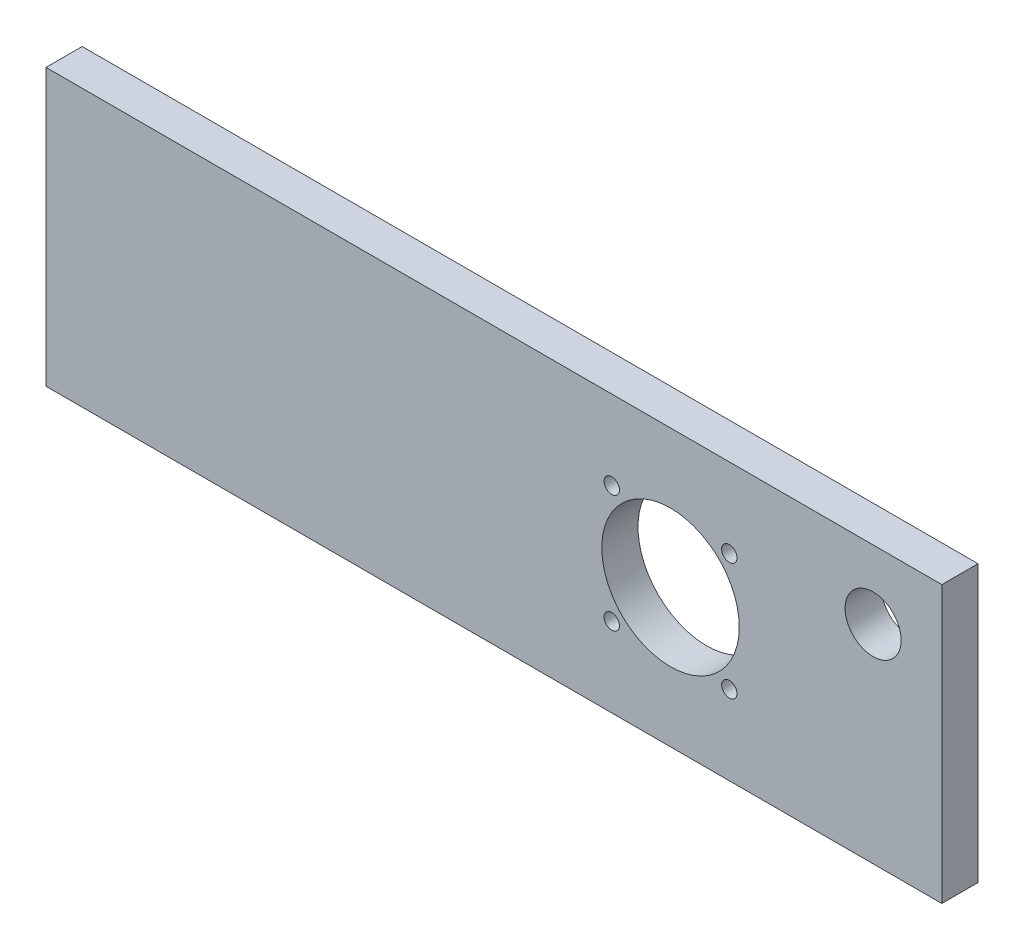
ISO-10303-21;
HEADER;
FILE_DESCRIPTION(('STEP AP214'),'2;1');
FILE_NAME('part.step','',(''),(''),'','','');
FILE_SCHEMA(('AUTOMOTIVE_DESIGN { 1 0 10303 214 1 1 1 1 }'));
ENDSEC;
DATA;
#1=APPLICATION_CONTEXT('core data for automotive mechanical design processes');
#2=APPLICATION_PROTOCOL_DEFINITION('international standard','automotive_design',2000,#1);
#3=PRODUCT_CONTEXT('',#1,'mechanical');
#4=PRODUCT('Part','Part','',(#3));
#5=PRODUCT_RELATED_PRODUCT_CATEGORY('part','',(#4));
#6=PRODUCT_DEFINITION_FORMATION('','',#4);
#7=PRODUCT_DEFINITION_CONTEXT('part definition',#1,'design');
#8=PRODUCT_DEFINITION('design','',#6,#7);
#9=PRODUCT_DEFINITION_SHAPE('','',#8);
#10=(LENGTH_UNIT() NAMED_UNIT(*) SI_UNIT(.MILLI.,.METRE.));
#11=(NAMED_UNIT(*) PLANE_ANGLE_UNIT() SI_UNIT($,.RADIAN.));
#12=(NAMED_UNIT(*) SI_UNIT($,.STERADIAN.) SOLID_ANGLE_UNIT());
#13=UNCERTAINTY_MEASURE_WITH_UNIT(LENGTH_MEASURE(1.E-05),#10,'distance_accuracy_value','');
#14=(GEOMETRIC_REPRESENTATION_CONTEXT(3) GLOBAL_UNCERTAINTY_ASSIGNED_CONTEXT((#13)) GLOBAL_UNIT_ASSIGNED_CONTEXT((#10,
#11,#12)) REPRESENTATION_CONTEXT('',''));
#15=CARTESIAN_POINT('',(0.,0.,0.));
#16=DIRECTION('',(0.,0.,1.));
#17=DIRECTION('',(1.,0.,0.));
#18=AXIS2_PLACEMENT_3D('',#15,#16,#17);
#19=CARTESIAN_POINT('',(0.,0.,10.));
#20=DIRECTION('',(0.,0.,-1.));
#21=DIRECTION('',(-1.,0.,0.));
#22=AXIS2_PLACEMENT_3D('',#19,#20,#21);
#23=PLANE('',#22);
#24=CARTESIAN_POINT('',(156.4,21.9262,10.));
#25=DIRECTION('',(0.,0.,1.));
#26=DIRECTION('',(1.,0.,0.));
#27=AXIS2_PLACEMENT_3D('',#24,#25,#26);
#28=CIRCLE('',#27,2.12499999999997);
#29=CARTESIAN_POINT('',(158.525,21.9262,10.));
#30=VERTEX_POINT('',#29);
#31=EDGE_CURVE('E133',#30,#30,#28,.T.);
#32=ORIENTED_EDGE('',*,*,#31,.F.);
#33=EDGE_LOOP('',(#32));
#34=FACE_BOUND('',#33,.T.);
#35=CARTESIAN_POINT('',(188.9,54.4262,10.));
#36=DIRECTION('',(0.,0.,1.));
#37=DIRECTION('',(1.,0.,0.));
#38=AXIS2_PLACEMENT_3D('',#35,#36,#37);
#39=CIRCLE('',#38,2.12499999999997);
#40=CARTESIAN_POINT('',(191.025,54.4262,10.));
#41=VERTEX_POINT('',#40);
#42=EDGE_CURVE('E121',#41,#41,#39,.T.);
#43=ORIENTED_EDGE('',*,*,#42,.F.);
#44=EDGE_LOOP('',(#43));
#45=FACE_BOUND('',#44,.T.);
#46=CARTESIAN_POINT('',(172.65,38.1762,10.));
#47=DIRECTION('',(0.,0.,1.));
#48=DIRECTION('',(1.,0.,0.));
#49=AXIS2_PLACEMENT_3D('',#46,#47,#48);
#50=CIRCLE('',#49,19.);
#51=CARTESIAN_POINT('',(191.65,38.1762,10.));
#52=VERTEX_POINT('',#51);
#53=EDGE_CURVE('E100',#52,#52,#50,.T.);
#54=ORIENTED_EDGE('',*,*,#53,.F.);
#55=EDGE_LOOP('',(#54));
#56=FACE_BOUND('',#55,.T.);
#57=DIRECTION('',(0.,-1.,0.));
#58=VECTOR('',#57,1.);
#59=CARTESIAN_POINT('',(0.,0.,10.));
#60=LINE('',#59,#58);
#61=CARTESIAN_POINT('',(0.,76.3524,10.));
#62=VERTEX_POINT('',#61);
#63=CARTESIAN_POINT('',(0.,0.,10.));
#64=VERTEX_POINT('',#63);
#65=EDGE_CURVE('E85',#62,#64,#60,.T.);
#66=ORIENTED_EDGE('',*,*,#65,.T.);
#67=DIRECTION('',(1.,0.,0.));
#68=VECTOR('',#67,1.);
#69=CARTESIAN_POINT('',(0.,0.,10.));
#70=LINE('',#69,#68);
#71=CARTESIAN_POINT('',(247.65,0.,10.));
#72=VERTEX_POINT('',#71);
#73=EDGE_CURVE('E80',#64,#72,#70,.T.);
#74=ORIENTED_EDGE('',*,*,#73,.T.);
#75=DIRECTION('',(0.,1.,0.));
#76=VECTOR('',#75,1.);
#77=CARTESIAN_POINT('',(247.65,0.,10.));
#78=LINE('',#77,#76);
#79=CARTESIAN_POINT('',(247.65,76.3524,10.));
#80=VERTEX_POINT('',#79);
#81=EDGE_CURVE('E83',#72,#80,#78,.T.);
#82=ORIENTED_EDGE('',*,*,#81,.T.);
#83=DIRECTION('',(-1.,0.,0.));
#84=VECTOR('',#83,1.);
#85=CARTESIAN_POINT('',(0.,76.3524,10.));
#86=LINE('',#85,#84);
#87=EDGE_CURVE('E50',#80,#62,#86,.T.);
#88=ORIENTED_EDGE('',*,*,#87,.T.);
#89=EDGE_LOOP('',(#66,#74,#82,#88));
#90=FACE_BOUND('',#89,.T.);
#91=CARTESIAN_POINT('',(156.4,54.4262,10.));
#92=DIRECTION('',(0.,0.,1.));
#93=DIRECTION('',(1.,0.,0.));
#94=AXIS2_PLACEMENT_3D('',#91,#92,#93);
#95=CIRCLE('',#94,2.12499999999997);
#96=CARTESIAN_POINT('',(158.525,54.4262,10.));
#97=VERTEX_POINT('',#96);
#98=EDGE_CURVE('E115',#97,#97,#95,.T.);
#99=ORIENTED_EDGE('',*,*,#98,.F.);
#100=EDGE_LOOP('',(#99));
#101=FACE_BOUND('',#100,.T.);
#102=CARTESIAN_POINT('',(188.9,21.9262,10.));
#103=DIRECTION('',(0.,0.,1.));
#104=DIRECTION('',(1.,0.,0.));
#105=AXIS2_PLACEMENT_3D('',#102,#103,#104);
#106=CIRCLE('',#105,2.12499999999997);
#107=CARTESIAN_POINT('',(191.025,21.9262,10.));
#108=VERTEX_POINT('',#107);
#109=EDGE_CURVE('E127',#108,#108,#106,.T.);
#110=ORIENTED_EDGE('',*,*,#109,.F.);
#111=EDGE_LOOP('',(#110));
#112=FACE_BOUND('',#111,.T.);
#113=CARTESIAN_POINT('',(228.65,57.3524,10.));
#114=DIRECTION('',(0.,0.,1.));
#115=DIRECTION('',(1.,0.,0.));
#116=AXIS2_PLACEMENT_3D('',#113,#114,#115);
#117=CIRCLE('',#116,7.75);
#118=CARTESIAN_POINT('',(236.4,57.3524,10.));
#119=VERTEX_POINT('',#118);
#120=EDGE_CURVE('E139',#119,#119,#117,.T.);
#121=ORIENTED_EDGE('',*,*,#120,.F.);
#122=EDGE_LOOP('',(#121));
#123=FACE_BOUND('',#122,.T.);
#124=ADVANCED_FACE('F33',(#34,#45,#56,#90,#101,#112,#123),#23,.F.);
#125=CARTESIAN_POINT('',(0.,0.,0.));
#126=DIRECTION('',(0.,0.,-1.));
#127=DIRECTION('',(-1.,0.,0.));
#128=AXIS2_PLACEMENT_3D('',#125,#126,#127);
#129=PLANE('',#128);
#130=CARTESIAN_POINT('',(156.4,21.9262,0.));
#131=DIRECTION('',(0.,0.,1.));
#132=DIRECTION('',(1.,0.,0.));
#133=AXIS2_PLACEMENT_3D('',#130,#131,#132);
#134=CIRCLE('',#133,2.12499999999997);
#135=CARTESIAN_POINT('',(158.525,21.9262,0.));
#136=VERTEX_POINT('',#135);
#137=EDGE_CURVE('E136',#136,#136,#134,.T.);
#138=ORIENTED_EDGE('',*,*,#137,.T.);
#139=EDGE_LOOP('',(#138));
#140=FACE_BOUND('',#139,.T.);
#141=CARTESIAN_POINT('',(188.9,54.4262,0.));
#142=DIRECTION('',(0.,0.,1.));
#143=DIRECTION('',(1.,0.,0.));
#144=AXIS2_PLACEMENT_3D('',#141,#142,#143);
#145=CIRCLE('',#144,2.12499999999997);
#146=CARTESIAN_POINT('',(191.025,54.4262,0.));
#147=VERTEX_POINT('',#146);
#148=EDGE_CURVE('E124',#147,#147,#145,.T.);
#149=ORIENTED_EDGE('',*,*,#148,.T.);
#150=EDGE_LOOP('',(#149));
#151=FACE_BOUND('',#150,.T.);
#152=CARTESIAN_POINT('',(172.65,38.1762,0.));
#153=DIRECTION('',(0.,0.,1.));
#154=DIRECTION('',(1.,0.,0.));
#155=AXIS2_PLACEMENT_3D('',#152,#153,#154);
#156=CIRCLE('',#155,19.);
#157=CARTESIAN_POINT('',(191.65,38.1762,0.));
#158=VERTEX_POINT('',#157);
#159=EDGE_CURVE('E112',#158,#158,#156,.T.);
#160=ORIENTED_EDGE('',*,*,#159,.T.);
#161=EDGE_LOOP('',(#160));
#162=FACE_BOUND('',#161,.T.);
#163=DIRECTION('',(0.,-1.,0.));
#164=VECTOR('',#163,1.);
#165=CARTESIAN_POINT('',(0.,0.,0.));
#166=LINE('',#165,#164);
#167=CARTESIAN_POINT('',(0.,76.3524,0.));
#168=VERTEX_POINT('',#167);
#169=CARTESIAN_POINT('',(0.,0.,0.));
#170=VERTEX_POINT('',#169);
#171=EDGE_CURVE('E97',#168,#170,#166,.T.);
#172=ORIENTED_EDGE('',*,*,#171,.F.);
#173=DIRECTION('',(-1.,0.,0.));
#174=VECTOR('',#173,1.);
#175=CARTESIAN_POINT('',(0.,76.3524,0.));
#176=LINE('',#175,#174);
#177=CARTESIAN_POINT('',(247.65,76.3524,0.));
#178=VERTEX_POINT('',#177);
#179=EDGE_CURVE('E73',#178,#168,#176,.T.);
#180=ORIENTED_EDGE('',*,*,#179,.F.);
#181=DIRECTION('',(0.,1.,0.));
#182=VECTOR('',#181,1.);
#183=CARTESIAN_POINT('',(247.65,0.,0.));
#184=LINE('',#183,#182);
#185=CARTESIAN_POINT('',(247.65,0.,0.));
#186=VERTEX_POINT('',#185);
#187=EDGE_CURVE('E67',#186,#178,#184,.T.);
#188=ORIENTED_EDGE('',*,*,#187,.F.);
#189=DIRECTION('',(1.,0.,0.));
#190=VECTOR('',#189,1.);
#191=CARTESIAN_POINT('',(0.,0.,0.));
#192=LINE('',#191,#190);
#193=EDGE_CURVE('E89',#170,#186,#192,.T.);
#194=ORIENTED_EDGE('',*,*,#193,.F.);
#195=EDGE_LOOP('',(#172,#180,#188,#194));
#196=FACE_BOUND('',#195,.T.);
#197=CARTESIAN_POINT('',(156.4,54.4262,0.));
#198=DIRECTION('',(0.,0.,1.));
#199=DIRECTION('',(1.,0.,0.));
#200=AXIS2_PLACEMENT_3D('',#197,#198,#199);
#201=CIRCLE('',#200,2.12499999999997);
#202=CARTESIAN_POINT('',(158.525,54.4262,0.));
#203=VERTEX_POINT('',#202);
#204=EDGE_CURVE('E118',#203,#203,#201,.T.);
#205=ORIENTED_EDGE('',*,*,#204,.T.);
#206=EDGE_LOOP('',(#205));
#207=FACE_BOUND('',#206,.T.);
#208=CARTESIAN_POINT('',(188.9,21.9262,0.));
#209=DIRECTION('',(0.,0.,1.));
#210=DIRECTION('',(1.,0.,0.));
#211=AXIS2_PLACEMENT_3D('',#208,#209,#210);
#212=CIRCLE('',#211,2.12499999999997);
#213=CARTESIAN_POINT('',(191.025,21.9262,0.));
#214=VERTEX_POINT('',#213);
#215=EDGE_CURVE('E130',#214,#214,#212,.T.);
#216=ORIENTED_EDGE('',*,*,#215,.T.);
#217=EDGE_LOOP('',(#216));
#218=FACE_BOUND('',#217,.T.);
#219=CARTESIAN_POINT('',(228.65,57.3524,0.));
#220=DIRECTION('',(0.,0.,1.));
#221=DIRECTION('',(1.,0.,0.));
#222=AXIS2_PLACEMENT_3D('',#219,#220,#221);
#223=CIRCLE('',#222,7.75);
#224=CARTESIAN_POINT('',(236.4,57.3524,0.));
#225=VERTEX_POINT('',#224);
#226=EDGE_CURVE('E142',#225,#225,#223,.T.);
#227=ORIENTED_EDGE('',*,*,#226,.T.);
#228=EDGE_LOOP('',(#227));
#229=FACE_BOUND('',#228,.T.);
#230=ADVANCED_FACE('F108',(#140,#151,#162,#196,#207,#218,#229),#129,.T.);
#231=CARTESIAN_POINT('',(0.,0.,10.));
#232=DIRECTION('',(1.,0.,0.));
#233=DIRECTION('',(0.,0.,-1.));
#234=AXIS2_PLACEMENT_3D('',#231,#232,#233);
#235=PLANE('',#234);
#236=ORIENTED_EDGE('',*,*,#171,.T.);
#237=DIRECTION('',(0.,0.,-1.));
#238=VECTOR('',#237,1.);
#239=CARTESIAN_POINT('',(0.,0.,10.));
#240=LINE('',#239,#238);
#241=EDGE_CURVE('E11',#64,#170,#240,.T.);
#242=ORIENTED_EDGE('',*,*,#241,.F.);
#243=ORIENTED_EDGE('',*,*,#65,.F.);
#244=DIRECTION('',(0.,0.,-1.));
#245=VECTOR('',#244,1.);
#246=CARTESIAN_POINT('',(0.,76.3524,10.));
#247=LINE('',#246,#245);
#248=EDGE_CURVE('E93',#62,#168,#247,.T.);
#249=ORIENTED_EDGE('',*,*,#248,.T.);
#250=EDGE_LOOP('',(#236,#242,#243,#249));
#251=FACE_BOUND('',#250,.T.);
#252=ADVANCED_FACE('F35',(#251),#235,.F.);
#253=CARTESIAN_POINT('',(0.,0.,10.));
#254=DIRECTION('',(0.,1.,0.));
#255=DIRECTION('',(0.,0.,1.));
#256=AXIS2_PLACEMENT_3D('',#253,#254,#255);
#257=PLANE('',#256);
#258=ORIENTED_EDGE('',*,*,#193,.T.);
#259=DIRECTION('',(0.,0.,-1.));
#260=VECTOR('',#259,1.);
#261=CARTESIAN_POINT('',(247.65,0.,10.));
#262=LINE('',#261,#260);
#263=EDGE_CURVE('E42',#72,#186,#262,.T.);
#264=ORIENTED_EDGE('',*,*,#263,.F.);
#265=ORIENTED_EDGE('',*,*,#73,.F.);
#266=ORIENTED_EDGE('',*,*,#241,.T.);
#267=EDGE_LOOP('',(#258,#264,#265,#266));
#268=FACE_BOUND('',#267,.T.);
#269=ADVANCED_FACE('F88',(#268),#257,.F.);
#270=CARTESIAN_POINT('',(247.65,0.,10.));
#271=DIRECTION('',(-1.,0.,0.));
#272=DIRECTION('',(0.,0.,1.));
#273=AXIS2_PLACEMENT_3D('',#270,#271,#272);
#274=PLANE('',#273);
#275=ORIENTED_EDGE('',*,*,#187,.T.);
#276=DIRECTION('',(0.,0.,-1.));
#277=VECTOR('',#276,1.);
#278=CARTESIAN_POINT('',(247.65,76.3524,10.));
#279=LINE('',#278,#277);
#280=EDGE_CURVE('E90',#80,#178,#279,.T.);
#281=ORIENTED_EDGE('',*,*,#280,.F.);
#282=ORIENTED_EDGE('',*,*,#81,.F.);
#283=ORIENTED_EDGE('',*,*,#263,.T.);
#284=EDGE_LOOP('',(#275,#281,#282,#283));
#285=FACE_BOUND('',#284,.T.);
#286=ADVANCED_FACE('F91',(#285),#274,.F.);
#287=CARTESIAN_POINT('',(0.,76.3524,10.));
#288=DIRECTION('',(0.,-1.,0.));
#289=DIRECTION('',(0.,0.,-1.));
#290=AXIS2_PLACEMENT_3D('',#287,#288,#289);
#291=PLANE('',#290);
#292=ORIENTED_EDGE('',*,*,#179,.T.);
#293=ORIENTED_EDGE('',*,*,#248,.F.);
#294=ORIENTED_EDGE('',*,*,#87,.F.);
#295=ORIENTED_EDGE('',*,*,#280,.T.);
#296=EDGE_LOOP('',(#292,#293,#294,#295));
#297=FACE_BOUND('',#296,.T.);
#298=ADVANCED_FACE('F105',(#297),#291,.F.);
#299=CARTESIAN_POINT('',(172.65,38.1762,10.));
#300=DIRECTION('',(0.,0.,-1.));
#301=DIRECTION('',(-1.,0.,0.));
#302=AXIS2_PLACEMENT_3D('',#299,#300,#301);
#303=CYLINDRICAL_SURFACE('',#302,19.);
#304=ORIENTED_EDGE('',*,*,#53,.T.);
#305=EDGE_LOOP('',(#304));
#306=FACE_BOUND('',#305,.T.);
#307=ORIENTED_EDGE('',*,*,#159,.F.);
#308=EDGE_LOOP('',(#307));
#309=FACE_BOUND('',#308,.T.);
#310=ADVANCED_FACE('F162',(#306,#309),#303,.F.);
#311=CARTESIAN_POINT('',(156.4,54.4262,10.));
#312=DIRECTION('',(0.,0.,-1.));
#313=DIRECTION('',(-1.,0.,0.));
#314=AXIS2_PLACEMENT_3D('',#311,#312,#313);
#315=CYLINDRICAL_SURFACE('',#314,2.12499999999997);
#316=ORIENTED_EDGE('',*,*,#98,.T.);
#317=EDGE_LOOP('',(#316));
#318=FACE_BOUND('',#317,.T.);
#319=ORIENTED_EDGE('',*,*,#204,.F.);
#320=EDGE_LOOP('',(#319));
#321=FACE_BOUND('',#320,.T.);
#322=ADVANCED_FACE('F208',(#318,#321),#315,.F.);
#323=CARTESIAN_POINT('',(188.9,54.4262,10.));
#324=DIRECTION('',(0.,0.,-1.));
#325=DIRECTION('',(-1.,0.,0.));
#326=AXIS2_PLACEMENT_3D('',#323,#324,#325);
#327=CYLINDRICAL_SURFACE('',#326,2.12499999999997);
#328=ORIENTED_EDGE('',*,*,#42,.T.);
#329=EDGE_LOOP('',(#328));
#330=FACE_BOUND('',#329,.T.);
#331=ORIENTED_EDGE('',*,*,#148,.F.);
#332=EDGE_LOOP('',(#331));
#333=FACE_BOUND('',#332,.T.);
#334=ADVANCED_FACE('F216',(#330,#333),#327,.F.);
#335=CARTESIAN_POINT('',(188.9,21.9262,10.));
#336=DIRECTION('',(0.,0.,-1.));
#337=DIRECTION('',(-1.,0.,0.));
#338=AXIS2_PLACEMENT_3D('',#335,#336,#337);
#339=CYLINDRICAL_SURFACE('',#338,2.12499999999997);
#340=ORIENTED_EDGE('',*,*,#109,.T.);
#341=EDGE_LOOP('',(#340));
#342=FACE_BOUND('',#341,.T.);
#343=ORIENTED_EDGE('',*,*,#215,.F.);
#344=EDGE_LOOP('',(#343));
#345=FACE_BOUND('',#344,.T.);
#346=ADVANCED_FACE('F224',(#342,#345),#339,.F.);
#347=CARTESIAN_POINT('',(156.4,21.9262,10.));
#348=DIRECTION('',(0.,0.,-1.));
#349=DIRECTION('',(-1.,0.,0.));
#350=AXIS2_PLACEMENT_3D('',#347,#348,#349);
#351=CYLINDRICAL_SURFACE('',#350,2.12499999999997);
#352=ORIENTED_EDGE('',*,*,#31,.T.);
#353=EDGE_LOOP('',(#352));
#354=FACE_BOUND('',#353,.T.);
#355=ORIENTED_EDGE('',*,*,#137,.F.);
#356=EDGE_LOOP('',(#355));
#357=FACE_BOUND('',#356,.T.);
#358=ADVANCED_FACE('F233',(#354,#357),#351,.F.);
#359=CARTESIAN_POINT('',(228.65,57.3524,10.));
#360=DIRECTION('',(0.,0.,-1.));
#361=DIRECTION('',(-1.,0.,0.));
#362=AXIS2_PLACEMENT_3D('',#359,#360,#361);
#363=CYLINDRICAL_SURFACE('',#362,7.75);
#364=ORIENTED_EDGE('',*,*,#120,.T.);
#365=EDGE_LOOP('',(#364));
#366=FACE_BOUND('',#365,.T.);
#367=ORIENTED_EDGE('',*,*,#226,.F.);
#368=EDGE_LOOP('',(#367));
#369=FACE_BOUND('',#368,.T.);
#370=ADVANCED_FACE('F148',(#366,#369),#363,.F.);
#371=CLOSED_SHELL('',(#124,#230,#252,#269,#286,#298,#310,#322,#334,#346,#358,#370));
#372=MANIFOLD_SOLID_BREP('B2',#371);
#373=ADVANCED_BREP_SHAPE_REPRESENTATION('',(#18,#372),#14);
#374=SHAPE_DEFINITION_REPRESENTATION(#9,#373);
ENDSEC;
END-ISO-10303-21;
